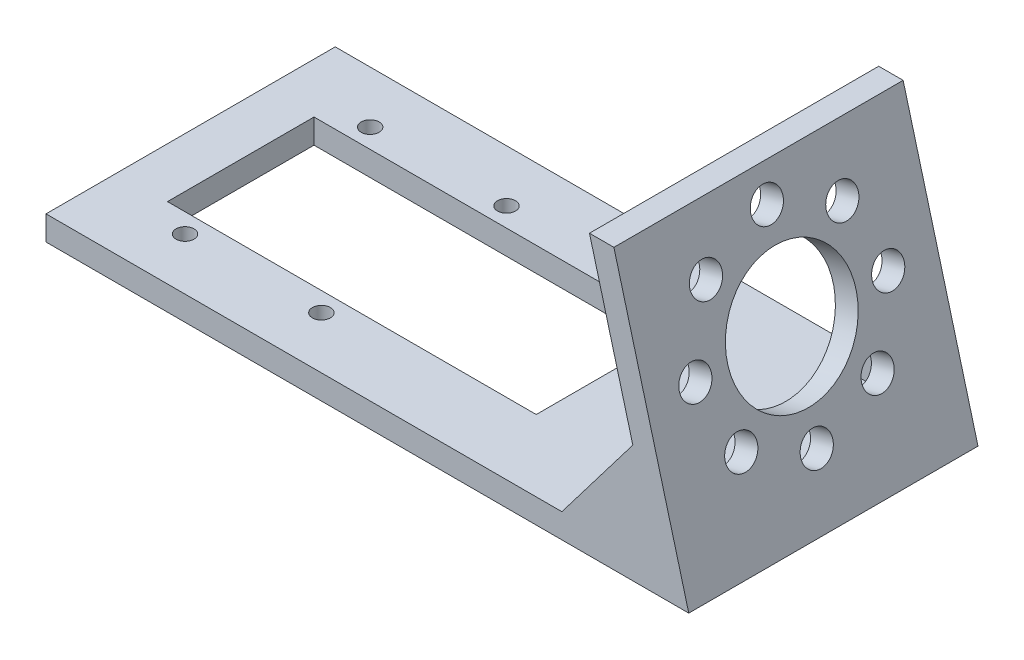
ISO-10303-21;
HEADER;
FILE_DESCRIPTION(('STEP AP214'),'2;1');
FILE_NAME('part.step','',(''),(''),'','','');
FILE_SCHEMA(('AUTOMOTIVE_DESIGN { 1 0 10303 214 1 1 1 1 }'));
ENDSEC;
DATA;
#1=APPLICATION_CONTEXT('core data for automotive mechanical design processes');
#2=APPLICATION_PROTOCOL_DEFINITION('international standard','automotive_design',2000,#1);
#3=PRODUCT_CONTEXT('',#1,'mechanical');
#4=PRODUCT('Part','Part','',(#3));
#5=PRODUCT_RELATED_PRODUCT_CATEGORY('part','',(#4));
#6=PRODUCT_DEFINITION_FORMATION('','',#4);
#7=PRODUCT_DEFINITION_CONTEXT('part definition',#1,'design');
#8=PRODUCT_DEFINITION('design','',#6,#7);
#9=PRODUCT_DEFINITION_SHAPE('','',#8);
#10=(LENGTH_UNIT() NAMED_UNIT(*) SI_UNIT(.MILLI.,.METRE.));
#11=(NAMED_UNIT(*) PLANE_ANGLE_UNIT() SI_UNIT($,.RADIAN.));
#12=(NAMED_UNIT(*) SI_UNIT($,.STERADIAN.) SOLID_ANGLE_UNIT());
#13=UNCERTAINTY_MEASURE_WITH_UNIT(LENGTH_MEASURE(1.E-05),#10,'distance_accuracy_value','');
#14=(GEOMETRIC_REPRESENTATION_CONTEXT(3) GLOBAL_UNCERTAINTY_ASSIGNED_CONTEXT((#13)) GLOBAL_UNIT_ASSIGNED_CONTEXT((#10,
#11,#12)) REPRESENTATION_CONTEXT('',''));
#15=CARTESIAN_POINT('',(0.,0.,0.));
#16=DIRECTION('',(0.,0.,1.));
#17=DIRECTION('',(1.,0.,0.));
#18=AXIS2_PLACEMENT_3D('',#15,#16,#17);
#19=CARTESIAN_POINT('',(57.6024915723907,55.2026609724202,57.15));
#20=DIRECTION('',(0.965925826289067,0.258819045102525,0.));
#21=DIRECTION('',(-0.258819045102525,0.965925826289067,0.));
#22=AXIS2_PLACEMENT_3D('',#19,#20,#21);
#23=PLANE('',#22);
#24=CARTESIAN_POINT('',(64.499776018663,29.4616449846778,47.625));
#25=DIRECTION('',(0.965925826289067,0.258819045102525,0.));
#26=DIRECTION('',(0.,0.,1.));
#27=AXIS2_PLACEMENT_3D('',#24,#25,#26);
#28=CIRCLE('',#27,3.175);
#29=CARTESIAN_POINT('',(64.499776018663,29.4616449846778,50.8));
#30=VERTEX_POINT('',#29);
#31=EDGE_CURVE('E208',#30,#30,#28,.F.);
#32=ORIENTED_EDGE('',*,*,#31,.F.);
#33=EDGE_LOOP('',(#32));
#34=FACE_BOUND('',#33,.T.);
#35=CARTESIAN_POINT('',(67.9861679897098,16.450253013631,42.0453841816037));
#36=DIRECTION('',(0.965925826289067,0.258819045102524,0.));
#37=DIRECTION('',(0.183012701892222,-0.683012701892222,0.707106781186544));
#38=AXIS2_PLACEMENT_3D('',#35,#36,#37);
#39=CIRCLE('',#38,3.175);
#40=CARTESIAN_POINT('',(68.5672333182176,14.2816876851232,44.2904482118709));
#41=VERTEX_POINT('',#40);
#42=EDGE_CURVE('E209',#41,#41,#39,.F.);
#43=ORIENTED_EDGE('',*,*,#42,.F.);
#44=EDGE_LOOP('',(#43));
#45=FACE_BOUND('',#44,.T.);
#46=CARTESIAN_POINT('',(69.4302788278661,11.0607579938711,28.575));
#47=DIRECTION('',(0.965925826289067,0.258819045102524,0.));
#48=DIRECTION('',(0.258819045102524,-0.965925826289068,0.));
#49=AXIS2_PLACEMENT_3D('',#46,#47,#48);
#50=CIRCLE('',#49,3.175);
#51=CARTESIAN_POINT('',(70.2520292960666,7.99394349540336,28.575));
#52=VERTEX_POINT('',#51);
#53=EDGE_CURVE('E216',#52,#52,#50,.F.);
#54=ORIENTED_EDGE('',*,*,#53,.F.);
#55=EDGE_LOOP('',(#54));
#56=FACE_BOUND('',#55,.T.);
#57=CARTESIAN_POINT('',(67.9861679897098,16.4502530136312,15.1046158183961));
#58=DIRECTION('',(0.965925826289067,0.258819045102524,0.));
#59=DIRECTION('',(0.18301270189222,-0.683012701892213,-0.707106781186554));
#60=AXIS2_PLACEMENT_3D('',#57,#58,#59);
#61=CIRCLE('',#60,3.175);
#62=CARTESIAN_POINT('',(68.5672333182176,14.2816876851235,12.8595517881288));
#63=VERTEX_POINT('',#62);
#64=EDGE_CURVE('E222',#63,#63,#61,.F.);
#65=ORIENTED_EDGE('',*,*,#64,.F.);
#66=EDGE_LOOP('',(#65));
#67=FACE_BOUND('',#66,.T.);
#68=CARTESIAN_POINT('',(64.4997760186629,29.4616449846781,9.52499999999998));
#69=DIRECTION('',(0.965925826289067,0.258819045102525,0.));
#70=DIRECTION('',(0.,0.,-1.));
#71=AXIS2_PLACEMENT_3D('',#68,#69,#70);
#72=CIRCLE('',#71,3.175);
#73=CARTESIAN_POINT('',(64.4997760186629,29.4616449846781,6.34999999999998));
#74=VERTEX_POINT('',#73);
#75=EDGE_CURVE('E196',#74,#74,#72,.F.);
#76=ORIENTED_EDGE('',*,*,#75,.F.);
#77=EDGE_LOOP('',(#76));
#78=FACE_BOUND('',#77,.T.);
#79=CARTESIAN_POINT('',(61.0133840476161,42.4730369557248,15.1046158183964));
#80=DIRECTION('',(0.965925826289067,0.258819045102525,0.));
#81=DIRECTION('',(-0.183012701892225,0.683012701892227,-0.707106781186539));
#82=AXIS2_PLACEMENT_3D('',#79,#80,#81);
#83=CIRCLE('',#82,3.175);
#84=CARTESIAN_POINT('',(60.4323187191083,44.6416022842326,12.8595517881292));
#85=VERTEX_POINT('',#84);
#86=EDGE_CURVE('E197',#85,#85,#83,.F.);
#87=ORIENTED_EDGE('',*,*,#86,.F.);
#88=EDGE_LOOP('',(#87));
#89=FACE_BOUND('',#88,.T.);
#90=CARTESIAN_POINT('',(61.0133840476161,42.4730369557246,42.0453841816038));
#91=DIRECTION('',(0.965925826289067,0.258819045102525,0.));
#92=DIRECTION('',(-0.183012701892222,0.683012701892217,0.707106781186549));
#93=AXIS2_PLACEMENT_3D('',#90,#91,#92);
#94=CIRCLE('',#93,3.175);
#95=CARTESIAN_POINT('',(60.4323187191083,44.6416022842324,44.2904482118711));
#96=VERTEX_POINT('',#95);
#97=EDGE_CURVE('E231',#96,#96,#94,.F.);
#98=ORIENTED_EDGE('',*,*,#97,.F.);
#99=EDGE_LOOP('',(#98));
#100=FACE_BOUND('',#99,.T.);
#101=CARTESIAN_POINT('',(59.5692732094599,47.8625319754846,28.575));
#102=DIRECTION('',(0.965925826289067,0.258819045102525,0.));
#103=DIRECTION('',(-0.258819045102525,0.965925826289067,0.));
#104=AXIS2_PLACEMENT_3D('',#101,#102,#103);
#105=CIRCLE('',#104,3.175);
#106=CARTESIAN_POINT('',(58.7475227412594,50.9293464739524,28.575));
#107=VERTEX_POINT('',#106);
#108=EDGE_CURVE('E237',#107,#107,#105,.F.);
#109=ORIENTED_EDGE('',*,*,#108,.F.);
#110=EDGE_LOOP('',(#109));
#111=FACE_BOUND('',#110,.T.);
#112=CARTESIAN_POINT('',(64.499776018663,29.4616449846779,28.575));
#113=DIRECTION('',(0.965925826289067,0.258819045102525,0.));
#114=DIRECTION('',(-0.258819045102525,0.965925826289067,0.));
#115=AXIS2_PLACEMENT_3D('',#112,#113,#114);
#116=CIRCLE('',#115,12.7);
#117=CARTESIAN_POINT('',(61.2127741458609,41.7289029785491,28.575));
#118=VERTEX_POINT('',#117);
#119=EDGE_CURVE('E241',#118,#118,#116,.F.);
#120=ORIENTED_EDGE('',*,*,#119,.F.);
#121=EDGE_LOOP('',(#120));
#122=FACE_BOUND('',#121,.T.);
#123=DIRECTION('',(0.258819045102525,-0.965925826289067,0.));
#124=VECTOR('',#123,1.);
#125=CARTESIAN_POINT('',(57.6024915723907,55.2026609724202,0.));
#126=LINE('',#125,#124);
#127=CARTESIAN_POINT('',(57.6024915723907,55.2026609724202,0.));
#128=VERTEX_POINT('',#127);
#129=CARTESIAN_POINT('',(66.1703743881243,23.2268869908067,0.));
#130=VERTEX_POINT('',#129);
#131=EDGE_CURVE('E300',#128,#130,#126,.T.);
#132=ORIENTED_EDGE('',*,*,#131,.T.);
#133=DIRECTION('',(0.,0.,-1.));
#134=VECTOR('',#133,1.);
#135=CARTESIAN_POINT('',(66.1703743881243,23.2268869908067,4.82600000000001));
#136=LINE('',#135,#134);
#137=CARTESIAN_POINT('',(66.1703743881243,23.2268869908068,4.82600000000001));
#138=VERTEX_POINT('',#137);
#139=EDGE_CURVE('E254',#138,#130,#136,.T.);
#140=ORIENTED_EDGE('',*,*,#139,.F.);
#141=DIRECTION('',(0.258819045102525,-0.965925826289067,0.));
#142=VECTOR('',#141,1.);
#143=CARTESIAN_POINT('',(67.5445215407852,18.0985000000003,4.82600000000001));
#144=LINE('',#143,#142);
#145=CARTESIAN_POINT('',(71.1008771973274,4.826,4.82600000000001));
#146=VERTEX_POINT('',#145);
#147=EDGE_CURVE('E250',#138,#146,#144,.T.);
#148=ORIENTED_EDGE('',*,*,#147,.T.);
#149=DIRECTION('',(0.,0.,-1.));
#150=VECTOR('',#149,1.);
#151=CARTESIAN_POINT('',(71.1008771973274,4.826,57.15));
#152=LINE('',#151,#150);
#153=CARTESIAN_POINT('',(71.1008771973274,4.826,52.324));
#154=VERTEX_POINT('',#153);
#155=EDGE_CURVE('E305',#154,#146,#152,.T.);
#156=ORIENTED_EDGE('',*,*,#155,.F.);
#157=DIRECTION('',(0.258819045102525,-0.965925826289067,0.));
#158=VECTOR('',#157,1.);
#159=CARTESIAN_POINT('',(67.5445215407852,18.0985000000003,52.324));
#160=LINE('',#159,#158);
#161=CARTESIAN_POINT('',(66.1703743881243,23.2268869908068,52.324));
#162=VERTEX_POINT('',#161);
#163=EDGE_CURVE('E266',#162,#154,#160,.T.);
#164=ORIENTED_EDGE('',*,*,#163,.F.);
#165=DIRECTION('',(0.,0.,1.));
#166=VECTOR('',#165,1.);
#167=CARTESIAN_POINT('',(66.1703743881243,23.2268869908068,52.324));
#168=LINE('',#167,#166);
#169=CARTESIAN_POINT('',(66.1703743881243,23.2268869908068,57.15));
#170=VERTEX_POINT('',#169);
#171=EDGE_CURVE('E270',#162,#170,#168,.T.);
#172=ORIENTED_EDGE('',*,*,#171,.T.);
#173=DIRECTION('',(0.258819045102525,-0.965925826289067,0.));
#174=VECTOR('',#173,1.);
#175=CARTESIAN_POINT('',(57.6024915723907,55.2026609724202,57.15));
#176=LINE('',#175,#174);
#177=CARTESIAN_POINT('',(57.6024915723907,55.2026609724202,57.15));
#178=VERTEX_POINT('',#177);
#179=EDGE_CURVE('E286',#178,#170,#176,.T.);
#180=ORIENTED_EDGE('',*,*,#179,.F.);
#181=DIRECTION('',(0.,0.,-1.));
#182=VECTOR('',#181,1.);
#183=CARTESIAN_POINT('',(57.6024915723907,55.2026609724202,57.15));
#184=LINE('',#183,#182);
#185=EDGE_CURVE('E308',#178,#128,#184,.T.);
#186=ORIENTED_EDGE('',*,*,#185,.T.);
#187=EDGE_LOOP('',(#132,#140,#148,#156,#164,#172,#180,#186));
#188=FACE_BOUND('',#187,.T.);
#189=ADVANCED_FACE('F39',(#34,#45,#56,#67,#78,#89,#100,#111,#122,#188),#23,.F.);
#190=CARTESIAN_POINT('',(71.1008771973274,4.826,57.15));
#191=DIRECTION('',(0.,-1.,0.));
#192=DIRECTION('',(1.,0.,0.));
#193=AXIS2_PLACEMENT_3D('',#190,#191,#192);
#194=PLANE('',#193);
#195=CARTESIAN_POINT('',(-32.595884,4.826,10.287));
#196=DIRECTION('',(0.,-1.,0.));
#197=DIRECTION('',(-1.,0.,0.));
#198=AXIS2_PLACEMENT_3D('',#195,#196,#197);
#199=CIRCLE('',#198,1.778);
#200=CARTESIAN_POINT('',(-34.373884,4.826,10.287));
#201=VERTEX_POINT('',#200);
#202=EDGE_CURVE('E397',#201,#201,#199,.T.);
#203=ORIENTED_EDGE('',*,*,#202,.T.);
#204=EDGE_LOOP('',(#203));
#205=FACE_BOUND('',#204,.T.);
#206=CARTESIAN_POINT('',(-5.65512000000001,4.826,10.287));
#207=DIRECTION('',(0.,-1.,0.));
#208=DIRECTION('',(-1.,0.,0.));
#209=AXIS2_PLACEMENT_3D('',#206,#207,#208);
#210=CIRCLE('',#209,1.778);
#211=CARTESIAN_POINT('',(-7.43312000000001,4.826,10.287));
#212=VERTEX_POINT('',#211);
#213=EDGE_CURVE('E164',#212,#212,#210,.T.);
#214=ORIENTED_EDGE('',*,*,#213,.T.);
#215=EDGE_LOOP('',(#214));
#216=FACE_BOUND('',#215,.T.);
#217=DIRECTION('',(0.,0.,1.));
#218=VECTOR('',#217,1.);
#219=CARTESIAN_POINT('',(-39.874,4.826,43.053));
#220=LINE('',#219,#218);
#221=CARTESIAN_POINT('',(-39.874,4.826,14.097));
#222=VERTEX_POINT('',#221);
#223=CARTESIAN_POINT('',(-39.874,4.826,43.053));
#224=VERTEX_POINT('',#223);
#225=EDGE_CURVE('E170',#222,#224,#220,.T.);
#226=ORIENTED_EDGE('',*,*,#225,.F.);
#227=DIRECTION('',(-1.,0.,0.));
#228=VECTOR('',#227,1.);
#229=CARTESIAN_POINT('',(-39.874,4.826,14.097));
#230=LINE('',#229,#228);
#231=CARTESIAN_POINT('',(32.98844,4.826,14.097));
#232=VERTEX_POINT('',#231);
#233=EDGE_CURVE('E54',#232,#222,#230,.T.);
#234=ORIENTED_EDGE('',*,*,#233,.F.);
#235=DIRECTION('',(0.,0.,-1.));
#236=VECTOR('',#235,1.);
#237=CARTESIAN_POINT('',(32.98844,4.826,14.097));
#238=LINE('',#237,#236);
#239=CARTESIAN_POINT('',(32.98844,4.826,43.053));
#240=VERTEX_POINT('',#239);
#241=EDGE_CURVE('E158',#240,#232,#238,.T.);
#242=ORIENTED_EDGE('',*,*,#241,.F.);
#243=DIRECTION('',(1.,0.,0.));
#244=VECTOR('',#243,1.);
#245=CARTESIAN_POINT('',(-39.874,4.826,43.053));
#246=LINE('',#245,#244);
#247=EDGE_CURVE('E161',#224,#240,#246,.T.);
#248=ORIENTED_EDGE('',*,*,#247,.F.);
#249=EDGE_LOOP('',(#226,#234,#242,#248));
#250=FACE_BOUND('',#249,.T.);
#251=CARTESIAN_POINT('',(-32.595884,4.826,46.863));
#252=DIRECTION('',(0.,1.,0.));
#253=DIRECTION('',(-1.,0.,0.));
#254=AXIS2_PLACEMENT_3D('',#251,#252,#253);
#255=CIRCLE('',#254,1.778);
#256=CARTESIAN_POINT('',(-34.373884,4.826,46.863));
#257=VERTEX_POINT('',#256);
#258=EDGE_CURVE('E183',#257,#257,#255,.T.);
#259=ORIENTED_EDGE('',*,*,#258,.F.);
#260=EDGE_LOOP('',(#259));
#261=FACE_BOUND('',#260,.T.);
#262=CARTESIAN_POINT('',(-5.65512000000001,4.826,46.863));
#263=DIRECTION('',(0.,1.,0.));
#264=DIRECTION('',(-1.,0.,0.));
#265=AXIS2_PLACEMENT_3D('',#262,#263,#264);
#266=CIRCLE('',#265,1.778);
#267=CARTESIAN_POINT('',(-7.43312000000001,4.826,46.863));
#268=VERTEX_POINT('',#267);
#269=EDGE_CURVE('E189',#268,#268,#266,.T.);
#270=ORIENTED_EDGE('',*,*,#269,.F.);
#271=EDGE_LOOP('',(#270));
#272=FACE_BOUND('',#271,.T.);
#273=DIRECTION('',(-1.,0.,0.));
#274=VECTOR('',#273,1.);
#275=CARTESIAN_POINT('',(0.,4.826,4.82600000000001));
#276=LINE('',#275,#274);
#277=CARTESIAN_POINT('',(52.1482550347824,4.826,4.82600000000001));
#278=VERTEX_POINT('',#277);
#279=EDGE_CURVE('E252',#146,#278,#276,.T.);
#280=ORIENTED_EDGE('',*,*,#279,.T.);
#281=DIRECTION('',(0.,0.,-1.));
#282=VECTOR('',#281,1.);
#283=CARTESIAN_POINT('',(52.1482550347824,4.826,4.82600000000001));
#284=LINE('',#283,#282);
#285=CARTESIAN_POINT('',(52.1482550347824,4.826,0.));
#286=VERTEX_POINT('',#285);
#287=EDGE_CURVE('E257',#278,#286,#284,.T.);
#288=ORIENTED_EDGE('',*,*,#287,.T.);
#289=DIRECTION('',(-1.,0.,0.));
#290=VECTOR('',#289,1.);
#291=CARTESIAN_POINT('',(71.1008771973274,4.826,0.));
#292=LINE('',#291,#290);
#293=CARTESIAN_POINT('',(-49.78,4.826,0.));
#294=VERTEX_POINT('',#293);
#295=EDGE_CURVE('E280',#286,#294,#292,.T.);
#296=ORIENTED_EDGE('',*,*,#295,.T.);
#297=DIRECTION('',(0.,0.,-1.));
#298=VECTOR('',#297,1.);
#299=CARTESIAN_POINT('',(-49.78,4.826,57.15));
#300=LINE('',#299,#298);
#301=CARTESIAN_POINT('',(-49.78,4.826,57.15));
#302=VERTEX_POINT('',#301);
#303=EDGE_CURVE('E291',#302,#294,#300,.T.);
#304=ORIENTED_EDGE('',*,*,#303,.F.);
#305=DIRECTION('',(-1.,0.,0.));
#306=VECTOR('',#305,1.);
#307=CARTESIAN_POINT('',(71.1008771973274,4.826,57.15));
#308=LINE('',#307,#306);
#309=CARTESIAN_POINT('',(52.1482550347824,4.826,57.15));
#310=VERTEX_POINT('',#309);
#311=EDGE_CURVE('E289',#310,#302,#308,.T.);
#312=ORIENTED_EDGE('',*,*,#311,.F.);
#313=DIRECTION('',(0.,0.,1.));
#314=VECTOR('',#313,1.);
#315=CARTESIAN_POINT('',(52.1482550347824,4.826,52.324));
#316=LINE('',#315,#314);
#317=CARTESIAN_POINT('',(52.1482550347824,4.826,52.324));
#318=VERTEX_POINT('',#317);
#319=EDGE_CURVE('E268',#318,#310,#316,.T.);
#320=ORIENTED_EDGE('',*,*,#319,.F.);
#321=DIRECTION('',(-1.,0.,0.));
#322=VECTOR('',#321,1.);
#323=CARTESIAN_POINT('',(0.,4.826,52.324));
#324=LINE('',#323,#322);
#325=EDGE_CURVE('E264',#154,#318,#324,.T.);
#326=ORIENTED_EDGE('',*,*,#325,.F.);
#327=ORIENTED_EDGE('',*,*,#155,.T.);
#328=EDGE_LOOP('',(#280,#288,#296,#304,#312,#320,#326,#327));
#329=FACE_BOUND('',#328,.T.);
#330=ADVANCED_FACE('F352',(#205,#216,#250,#261,#272,#329),#194,.F.);
#331=CARTESIAN_POINT('',(-49.78,4.826,57.15));
#332=DIRECTION('',(1.,0.,0.));
#333=DIRECTION('',(0.,0.,-1.));
#334=AXIS2_PLACEMENT_3D('',#331,#332,#333);
#335=PLANE('',#334);
#336=DIRECTION('',(0.,-1.,0.));
#337=VECTOR('',#336,1.);
#338=CARTESIAN_POINT('',(-49.78,4.826,0.));
#339=LINE('',#338,#337);
#340=CARTESIAN_POINT('',(-49.78,0.,0.));
#341=VERTEX_POINT('',#340);
#342=EDGE_CURVE('E273',#294,#341,#339,.T.);
#343=ORIENTED_EDGE('',*,*,#342,.T.);
#344=DIRECTION('',(0.,0.,-1.));
#345=VECTOR('',#344,1.);
#346=CARTESIAN_POINT('',(-49.78,0.,57.15));
#347=LINE('',#346,#345);
#348=CARTESIAN_POINT('',(-49.78,0.,57.15));
#349=VERTEX_POINT('',#348);
#350=EDGE_CURVE('E11',#349,#341,#347,.T.);
#351=ORIENTED_EDGE('',*,*,#350,.F.);
#352=DIRECTION('',(0.,-1.,0.));
#353=VECTOR('',#352,1.);
#354=CARTESIAN_POINT('',(-49.78,4.826,57.15));
#355=LINE('',#354,#353);
#356=EDGE_CURVE('E276',#302,#349,#355,.T.);
#357=ORIENTED_EDGE('',*,*,#356,.F.);
#358=ORIENTED_EDGE('',*,*,#303,.T.);
#359=EDGE_LOOP('',(#343,#351,#357,#358));
#360=FACE_BOUND('',#359,.T.);
#361=ADVANCED_FACE('F41',(#360),#335,.F.);
#362=CARTESIAN_POINT('',(-49.78,0.,57.15));
#363=DIRECTION('',(0.,1.,0.));
#364=DIRECTION('',(0.,0.,1.));
#365=AXIS2_PLACEMENT_3D('',#362,#363,#364);
#366=PLANE('',#365);
#367=CARTESIAN_POINT('',(-32.595884,0.,10.287));
#368=DIRECTION('',(0.,-1.,0.));
#369=DIRECTION('',(-1.,0.,0.));
#370=AXIS2_PLACEMENT_3D('',#367,#368,#369);
#371=CIRCLE('',#370,1.778);
#372=CARTESIAN_POINT('',(-34.373884,0.,10.287));
#373=VERTEX_POINT('',#372);
#374=EDGE_CURVE('E192',#373,#373,#371,.T.);
#375=ORIENTED_EDGE('',*,*,#374,.F.);
#376=EDGE_LOOP('',(#375));
#377=FACE_BOUND('',#376,.T.);
#378=CARTESIAN_POINT('',(-5.65512000000001,0.,10.287));
#379=DIRECTION('',(0.,-1.,0.));
#380=DIRECTION('',(-1.,0.,0.));
#381=AXIS2_PLACEMENT_3D('',#378,#379,#380);
#382=CIRCLE('',#381,1.778);
#383=CARTESIAN_POINT('',(-7.43312000000001,0.,10.287));
#384=VERTEX_POINT('',#383);
#385=EDGE_CURVE('E395',#384,#384,#382,.T.);
#386=ORIENTED_EDGE('',*,*,#385,.F.);
#387=EDGE_LOOP('',(#386));
#388=FACE_BOUND('',#387,.T.);
#389=DIRECTION('',(0.,0.,-1.));
#390=VECTOR('',#389,1.);
#391=CARTESIAN_POINT('',(32.98844,0.,14.097));
#392=LINE('',#391,#390);
#393=CARTESIAN_POINT('',(32.98844,0.,43.053));
#394=VERTEX_POINT('',#393);
#395=CARTESIAN_POINT('',(32.98844,0.,14.097));
#396=VERTEX_POINT('',#395);
#397=EDGE_CURVE('E148',#394,#396,#392,.T.);
#398=ORIENTED_EDGE('',*,*,#397,.T.);
#399=DIRECTION('',(-1.,0.,0.));
#400=VECTOR('',#399,1.);
#401=CARTESIAN_POINT('',(-39.874,0.,14.097));
#402=LINE('',#401,#400);
#403=CARTESIAN_POINT('',(-39.874,0.,14.097));
#404=VERTEX_POINT('',#403);
#405=EDGE_CURVE('E142',#396,#404,#402,.T.);
#406=ORIENTED_EDGE('',*,*,#405,.T.);
#407=DIRECTION('',(0.,0.,1.));
#408=VECTOR('',#407,1.);
#409=CARTESIAN_POINT('',(-39.874,0.,43.053));
#410=LINE('',#409,#408);
#411=CARTESIAN_POINT('',(-39.874,0.,43.053));
#412=VERTEX_POINT('',#411);
#413=EDGE_CURVE('E151',#404,#412,#410,.T.);
#414=ORIENTED_EDGE('',*,*,#413,.T.);
#415=DIRECTION('',(1.,0.,0.));
#416=VECTOR('',#415,1.);
#417=CARTESIAN_POINT('',(-39.874,0.,43.053));
#418=LINE('',#417,#416);
#419=EDGE_CURVE('E62',#412,#394,#418,.T.);
#420=ORIENTED_EDGE('',*,*,#419,.T.);
#421=EDGE_LOOP('',(#398,#406,#414,#420));
#422=FACE_BOUND('',#421,.T.);
#423=CARTESIAN_POINT('',(-32.595884,0.,46.863));
#424=DIRECTION('',(0.,1.,0.));
#425=DIRECTION('',(-1.,0.,0.));
#426=AXIS2_PLACEMENT_3D('',#423,#424,#425);
#427=CIRCLE('',#426,1.778);
#428=CARTESIAN_POINT('',(-34.373884,0.,46.863));
#429=VERTEX_POINT('',#428);
#430=EDGE_CURVE('E171',#429,#429,#427,.T.);
#431=ORIENTED_EDGE('',*,*,#430,.T.);
#432=EDGE_LOOP('',(#431));
#433=FACE_BOUND('',#432,.T.);
#434=CARTESIAN_POINT('',(-5.65512000000001,0.,46.863));
#435=DIRECTION('',(0.,1.,0.));
#436=DIRECTION('',(-1.,0.,0.));
#437=AXIS2_PLACEMENT_3D('',#434,#435,#436);
#438=CIRCLE('',#437,1.778);
#439=CARTESIAN_POINT('',(-7.43312000000001,0.,46.863));
#440=VERTEX_POINT('',#439);
#441=EDGE_CURVE('E186',#440,#440,#438,.T.);
#442=ORIENTED_EDGE('',*,*,#441,.T.);
#443=EDGE_LOOP('',(#442));
#444=FACE_BOUND('',#443,.T.);
#445=DIRECTION('',(1.,0.,0.));
#446=VECTOR('',#445,1.);
#447=CARTESIAN_POINT('',(-49.78,0.,0.));
#448=LINE('',#447,#446);
#449=CARTESIAN_POINT('',(77.22,0.,0.));
#450=VERTEX_POINT('',#449);
#451=EDGE_CURVE('E294',#341,#450,#448,.T.);
#452=ORIENTED_EDGE('',*,*,#451,.T.);
#453=DIRECTION('',(0.,0.,-1.));
#454=VECTOR('',#453,1.);
#455=CARTESIAN_POINT('',(77.22,0.,57.15));
#456=LINE('',#455,#454);
#457=CARTESIAN_POINT('',(77.22,0.,57.15));
#458=VERTEX_POINT('',#457);
#459=EDGE_CURVE('E47',#458,#450,#456,.T.);
#460=ORIENTED_EDGE('',*,*,#459,.F.);
#461=DIRECTION('',(1.,0.,0.));
#462=VECTOR('',#461,1.);
#463=CARTESIAN_POINT('',(-49.78,0.,57.15));
#464=LINE('',#463,#462);
#465=EDGE_CURVE('E279',#349,#458,#464,.T.);
#466=ORIENTED_EDGE('',*,*,#465,.F.);
#467=ORIENTED_EDGE('',*,*,#350,.T.);
#468=EDGE_LOOP('',(#452,#460,#466,#467));
#469=FACE_BOUND('',#468,.T.);
#470=ADVANCED_FACE('F155',(#377,#388,#422,#433,#444,#469),#366,.F.);
#471=CARTESIAN_POINT('',(77.22,0.,57.15));
#472=DIRECTION('',(-0.965925826289067,-0.258819045102525,0.));
#473=DIRECTION('',(0.258819045102525,-0.965925826289067,0.));
#474=AXIS2_PLACEMENT_3D('',#471,#472,#473);
#475=PLANE('',#474);
#476=CARTESIAN_POINT('',(69.0024953179949,30.6681449846779,47.625));
#477=DIRECTION('',(0.965925826289067,0.258819045102525,0.));
#478=DIRECTION('',(0.,0.,1.));
#479=AXIS2_PLACEMENT_3D('',#476,#477,#478);
#480=CIRCLE('',#479,3.175);
#481=CARTESIAN_POINT('',(69.0024953179949,30.6681449846778,50.8));
#482=VERTEX_POINT('',#481);
#483=EDGE_CURVE('E205',#482,#482,#480,.T.);
#484=ORIENTED_EDGE('',*,*,#483,.F.);
#485=EDGE_LOOP('',(#484));
#486=FACE_BOUND('',#485,.T.);
#487=CARTESIAN_POINT('',(72.4888872890417,17.6567530136311,42.0453841816037));
#488=DIRECTION('',(0.965925826289068,0.258819045102524,0.));
#489=DIRECTION('',(0.183012701892223,-0.683012701892222,0.707106781186544));
#490=AXIS2_PLACEMENT_3D('',#487,#488,#489);
#491=CIRCLE('',#490,3.175);
#492=CARTESIAN_POINT('',(73.0699526175495,15.4881876851233,44.2904482118709));
#493=VERTEX_POINT('',#492);
#494=EDGE_CURVE('E213',#493,#493,#491,.T.);
#495=ORIENTED_EDGE('',*,*,#494,.F.);
#496=EDGE_LOOP('',(#495));
#497=FACE_BOUND('',#496,.T.);
#498=CARTESIAN_POINT('',(73.9329981271979,12.2672579938712,28.575));
#499=DIRECTION('',(0.965925826289068,0.258819045102524,0.));
#500=DIRECTION('',(0.258819045102525,-0.965925826289068,0.));
#501=AXIS2_PLACEMENT_3D('',#498,#499,#500);
#502=CIRCLE('',#501,3.175);
#503=CARTESIAN_POINT('',(74.7547485953985,9.20044349540339,28.575));
#504=VERTEX_POINT('',#503);
#505=EDGE_CURVE('E219',#504,#504,#502,.T.);
#506=ORIENTED_EDGE('',*,*,#505,.F.);
#507=EDGE_LOOP('',(#506));
#508=FACE_BOUND('',#507,.T.);
#509=CARTESIAN_POINT('',(72.4888872890417,17.6567530136313,15.1046158183961));
#510=DIRECTION('',(0.965925826289067,0.258819045102525,0.));
#511=DIRECTION('',(0.18301270189222,-0.683012701892213,-0.707106781186554));
#512=AXIS2_PLACEMENT_3D('',#509,#510,#511);
#513=CIRCLE('',#512,3.175);
#514=CARTESIAN_POINT('',(73.0699526175494,15.4881876851235,12.8595517881288));
#515=VERTEX_POINT('',#514);
#516=EDGE_CURVE('E200',#515,#515,#513,.T.);
#517=ORIENTED_EDGE('',*,*,#516,.F.);
#518=EDGE_LOOP('',(#517));
#519=FACE_BOUND('',#518,.T.);
#520=CARTESIAN_POINT('',(69.0024953179948,30.6681449846781,9.52499999999998));
#521=DIRECTION('',(0.965925826289068,0.258819045102525,0.));
#522=DIRECTION('',(0.,0.,-1.));
#523=AXIS2_PLACEMENT_3D('',#520,#521,#522);
#524=CIRCLE('',#523,3.175);
#525=CARTESIAN_POINT('',(69.0024953179948,30.6681449846781,6.34999999999998));
#526=VERTEX_POINT('',#525);
#527=EDGE_CURVE('E193',#526,#526,#524,.T.);
#528=ORIENTED_EDGE('',*,*,#527,.F.);
#529=EDGE_LOOP('',(#528));
#530=FACE_BOUND('',#529,.T.);
#531=CARTESIAN_POINT('',(65.516103346948,43.6795369557248,15.1046158183964));
#532=DIRECTION('',(0.965925826289067,0.258819045102525,0.));
#533=DIRECTION('',(-0.183012701892225,0.683012701892227,-0.707106781186539));
#534=AXIS2_PLACEMENT_3D('',#531,#532,#533);
#535=CIRCLE('',#534,3.175);
#536=CARTESIAN_POINT('',(64.9350380184402,45.8481022842327,12.8595517881292));
#537=VERTEX_POINT('',#536);
#538=EDGE_CURVE('E177',#537,#537,#535,.T.);
#539=ORIENTED_EDGE('',*,*,#538,.F.);
#540=EDGE_LOOP('',(#539));
#541=FACE_BOUND('',#540,.T.);
#542=CARTESIAN_POINT('',(65.516103346948,43.6795369557247,42.0453841816038));
#543=DIRECTION('',(0.965925826289067,0.258819045102525,0.));
#544=DIRECTION('',(-0.183012701892222,0.683012701892217,0.707106781186549));
#545=AXIS2_PLACEMENT_3D('',#542,#543,#544);
#546=CIRCLE('',#545,3.175);
#547=CARTESIAN_POINT('',(64.9350380184402,45.8481022842325,44.2904482118711));
#548=VERTEX_POINT('',#547);
#549=EDGE_CURVE('E212',#548,#548,#546,.T.);
#550=ORIENTED_EDGE('',*,*,#549,.F.);
#551=EDGE_LOOP('',(#550));
#552=FACE_BOUND('',#551,.T.);
#553=CARTESIAN_POINT('',(64.0719925087917,49.0690319754847,28.575));
#554=DIRECTION('',(0.965925826289067,0.258819045102525,0.));
#555=DIRECTION('',(-0.258819045102525,0.965925826289067,0.));
#556=AXIS2_PLACEMENT_3D('',#553,#554,#555);
#557=CIRCLE('',#556,3.175);
#558=CARTESIAN_POINT('',(63.2502420405912,52.1358464739524,28.575));
#559=VERTEX_POINT('',#558);
#560=EDGE_CURVE('E234',#559,#559,#557,.T.);
#561=ORIENTED_EDGE('',*,*,#560,.F.);
#562=EDGE_LOOP('',(#561));
#563=FACE_BOUND('',#562,.T.);
#564=CARTESIAN_POINT('',(69.0024953179949,30.6681449846779,28.575));
#565=DIRECTION('',(0.965925826289067,0.258819045102525,0.));
#566=DIRECTION('',(-0.258819045102525,0.965925826289067,0.));
#567=AXIS2_PLACEMENT_3D('',#564,#565,#566);
#568=CIRCLE('',#567,12.7);
#569=CARTESIAN_POINT('',(65.7154934451928,42.9354029785491,28.575));
#570=VERTEX_POINT('',#569);
#571=EDGE_CURVE('E240',#570,#570,#568,.T.);
#572=ORIENTED_EDGE('',*,*,#571,.F.);
#573=EDGE_LOOP('',(#572));
#574=FACE_BOUND('',#573,.T.);
#575=DIRECTION('',(-0.258819045102525,0.965925826289067,0.));
#576=VECTOR('',#575,1.);
#577=CARTESIAN_POINT('',(77.22,0.,0.));
#578=LINE('',#577,#576);
#579=CARTESIAN_POINT('',(62.4284915723907,55.2026609724202,0.));
#580=VERTEX_POINT('',#579);
#581=EDGE_CURVE('E296',#450,#580,#578,.T.);
#582=ORIENTED_EDGE('',*,*,#581,.T.);
#583=DIRECTION('',(0.,0.,-1.));
#584=VECTOR('',#583,1.);
#585=CARTESIAN_POINT('',(62.4284915723907,55.2026609724202,57.15));
#586=LINE('',#585,#584);
#587=CARTESIAN_POINT('',(62.4284915723907,55.2026609724202,57.15));
#588=VERTEX_POINT('',#587);
#589=EDGE_CURVE('E311',#588,#580,#586,.T.);
#590=ORIENTED_EDGE('',*,*,#589,.F.);
#591=DIRECTION('',(-0.258819045102525,0.965925826289067,0.));
#592=VECTOR('',#591,1.);
#593=CARTESIAN_POINT('',(77.22,0.,57.15));
#594=LINE('',#593,#592);
#595=EDGE_CURVE('E282',#458,#588,#594,.T.);
#596=ORIENTED_EDGE('',*,*,#595,.F.);
#597=ORIENTED_EDGE('',*,*,#459,.T.);
#598=EDGE_LOOP('',(#582,#590,#596,#597));
#599=FACE_BOUND('',#598,.T.);
#600=ADVANCED_FACE('F318',(#486,#497,#508,#519,#530,#541,#552,#563,#574,#599),#475,.F.);
#601=CARTESIAN_POINT('',(62.4284915723907,55.2026609724202,57.15));
#602=DIRECTION('',(0.,-1.,0.));
#603=DIRECTION('',(0.,0.,-1.));
#604=AXIS2_PLACEMENT_3D('',#601,#602,#603);
#605=PLANE('',#604);
#606=DIRECTION('',(-1.,0.,0.));
#607=VECTOR('',#606,1.);
#608=CARTESIAN_POINT('',(62.4284915723907,55.2026609724202,0.));
#609=LINE('',#608,#607);
#610=EDGE_CURVE('E298',#580,#128,#609,.T.);
#611=ORIENTED_EDGE('',*,*,#610,.T.);
#612=ORIENTED_EDGE('',*,*,#185,.F.);
#613=DIRECTION('',(-1.,0.,0.));
#614=VECTOR('',#613,1.);
#615=CARTESIAN_POINT('',(62.4284915723907,55.2026609724202,57.15));
#616=LINE('',#615,#614);
#617=EDGE_CURVE('E284',#588,#178,#616,.T.);
#618=ORIENTED_EDGE('',*,*,#617,.F.);
#619=ORIENTED_EDGE('',*,*,#589,.T.);
#620=EDGE_LOOP('',(#611,#612,#618,#619));
#621=FACE_BOUND('',#620,.T.);
#622=ADVANCED_FACE('F329',(#621),#605,.F.);
#623=CARTESIAN_POINT('',(0.,0.,57.15));
#624=DIRECTION('',(0.,0.,1.));
#625=DIRECTION('',(1.,0.,0.));
#626=AXIS2_PLACEMENT_3D('',#623,#624,#625);
#627=PLANE('',#626);
#628=ORIENTED_EDGE('',*,*,#356,.T.);
#629=ORIENTED_EDGE('',*,*,#465,.T.);
#630=ORIENTED_EDGE('',*,*,#595,.T.);
#631=ORIENTED_EDGE('',*,*,#617,.T.);
#632=ORIENTED_EDGE('',*,*,#179,.T.);
#633=DIRECTION('',(0.606108739732748,0.795381792361115,0.));
#634=VECTOR('',#633,1.);
#635=CARTESIAN_POINT('',(30.6641090884171,-23.3671234281533,57.15));
#636=LINE('',#635,#634);
#637=EDGE_CURVE('E259',#310,#170,#636,.T.);
#638=ORIENTED_EDGE('',*,*,#637,.F.);
#639=ORIENTED_EDGE('',*,*,#311,.T.);
#640=EDGE_LOOP('',(#628,#629,#630,#631,#632,#638,#639));
#641=FACE_BOUND('',#640,.T.);
#642=ADVANCED_FACE('F336',(#641),#627,.T.);
#643=CARTESIAN_POINT('',(0.,0.,0.));
#644=DIRECTION('',(0.,0.,1.));
#645=DIRECTION('',(1.,0.,0.));
#646=AXIS2_PLACEMENT_3D('',#643,#644,#645);
#647=PLANE('',#646);
#648=ORIENTED_EDGE('',*,*,#295,.F.);
#649=DIRECTION('',(0.606108739732748,0.795381792361115,0.));
#650=VECTOR('',#649,1.);
#651=CARTESIAN_POINT('',(30.6641090884171,-23.3671234281533,0.));
#652=LINE('',#651,#650);
#653=EDGE_CURVE('E244',#286,#130,#652,.T.);
#654=ORIENTED_EDGE('',*,*,#653,.T.);
#655=ORIENTED_EDGE('',*,*,#131,.F.);
#656=ORIENTED_EDGE('',*,*,#610,.F.);
#657=ORIENTED_EDGE('',*,*,#581,.F.);
#658=ORIENTED_EDGE('',*,*,#451,.F.);
#659=ORIENTED_EDGE('',*,*,#342,.F.);
#660=EDGE_LOOP('',(#648,#654,#655,#656,#657,#658,#659));
#661=FACE_BOUND('',#660,.T.);
#662=ADVANCED_FACE('F324',(#661),#647,.F.);
#663=CARTESIAN_POINT('',(30.6641090884171,-23.3671234281533,52.324));
#664=DIRECTION('',(0.795381792361115,-0.606108739732748,0.));
#665=DIRECTION('',(0.606108739732748,0.795381792361115,0.));
#666=AXIS2_PLACEMENT_3D('',#663,#664,#665);
#667=PLANE('',#666);
#668=ORIENTED_EDGE('',*,*,#637,.T.);
#669=ORIENTED_EDGE('',*,*,#171,.F.);
#670=DIRECTION('',(0.606108739732748,0.795381792361115,0.));
#671=VECTOR('',#670,1.);
#672=CARTESIAN_POINT('',(30.6641090884171,-23.3671234281533,52.324));
#673=LINE('',#672,#671);
#674=EDGE_CURVE('E262',#318,#162,#673,.T.);
#675=ORIENTED_EDGE('',*,*,#674,.F.);
#676=ORIENTED_EDGE('',*,*,#319,.T.);
#677=EDGE_LOOP('',(#668,#669,#675,#676));
#678=FACE_BOUND('',#677,.T.);
#679=ADVANCED_FACE('F359',(#678),#667,.F.);
#680=CARTESIAN_POINT('',(0.,0.,52.324));
#681=DIRECTION('',(0.,0.,1.));
#682=DIRECTION('',(1.,0.,0.));
#683=AXIS2_PLACEMENT_3D('',#680,#681,#682);
#684=PLANE('',#683);
#685=ORIENTED_EDGE('',*,*,#674,.T.);
#686=ORIENTED_EDGE('',*,*,#163,.T.);
#687=ORIENTED_EDGE('',*,*,#325,.T.);
#688=EDGE_LOOP('',(#685,#686,#687));
#689=FACE_BOUND('',#688,.T.);
#690=ADVANCED_FACE('F356',(#689),#684,.F.);
#691=CARTESIAN_POINT('',(30.6641090884171,-23.3671234281533,4.82600000000002));
#692=DIRECTION('',(-0.795381792361115,0.606108739732748,0.));
#693=DIRECTION('',(-0.606108739732748,-0.795381792361115,0.));
#694=AXIS2_PLACEMENT_3D('',#691,#692,#693);
#695=PLANE('',#694);
#696=ORIENTED_EDGE('',*,*,#653,.F.);
#697=ORIENTED_EDGE('',*,*,#287,.F.);
#698=DIRECTION('',(0.606108739732748,0.795381792361115,0.));
#699=VECTOR('',#698,1.);
#700=CARTESIAN_POINT('',(30.6641090884171,-23.3671234281533,4.82600000000002));
#701=LINE('',#700,#699);
#702=EDGE_CURVE('E247',#278,#138,#701,.T.);
#703=ORIENTED_EDGE('',*,*,#702,.T.);
#704=ORIENTED_EDGE('',*,*,#139,.T.);
#705=EDGE_LOOP('',(#696,#697,#703,#704));
#706=FACE_BOUND('',#705,.T.);
#707=ADVANCED_FACE('F345',(#706),#695,.T.);
#708=CARTESIAN_POINT('',(0.,0.,4.82600000000001));
#709=DIRECTION('',(0.,0.,-1.));
#710=DIRECTION('',(1.,0.,0.));
#711=AXIS2_PLACEMENT_3D('',#708,#709,#710);
#712=PLANE('',#711);
#713=ORIENTED_EDGE('',*,*,#702,.F.);
#714=ORIENTED_EDGE('',*,*,#279,.F.);
#715=ORIENTED_EDGE('',*,*,#147,.F.);
#716=EDGE_LOOP('',(#713,#714,#715));
#717=FACE_BOUND('',#716,.T.);
#718=ADVANCED_FACE('F351',(#717),#712,.F.);
#719=CARTESIAN_POINT('',(-49.4913008350187,-1.08217200262069,28.575));
#720=DIRECTION('',(0.965925826289067,0.258819045102525,0.));
#721=DIRECTION('',(-0.258819045102525,0.965925826289067,0.));
#722=AXIS2_PLACEMENT_3D('',#719,#720,#721);
#723=CYLINDRICAL_SURFACE('',#722,12.7);
#724=ORIENTED_EDGE('',*,*,#571,.T.);
#725=EDGE_LOOP('',(#724));
#726=FACE_BOUND('',#725,.T.);
#727=ORIENTED_EDGE('',*,*,#119,.T.);
#728=EDGE_LOOP('',(#727));
#729=FACE_BOUND('',#728,.T.);
#730=ADVANCED_FACE('F462',(#726,#729),#723,.F.);
#731=CARTESIAN_POINT('',(-54.4218036442218,17.318714988186,28.575));
#732=DIRECTION('',(0.965925826289067,0.258819045102525,0.));
#733=DIRECTION('',(-0.258819045102525,0.965925826289067,0.));
#734=AXIS2_PLACEMENT_3D('',#731,#732,#733);
#735=CYLINDRICAL_SURFACE('',#734,3.175);
#736=ORIENTED_EDGE('',*,*,#560,.T.);
#737=EDGE_LOOP('',(#736));
#738=FACE_BOUND('',#737,.T.);
#739=ORIENTED_EDGE('',*,*,#108,.T.);
#740=EDGE_LOOP('',(#739));
#741=FACE_BOUND('',#740,.T.);
#742=ADVANCED_FACE('F458',(#738,#741),#735,.F.);
#743=CARTESIAN_POINT('',(-52.9776928060655,11.9292199684261,42.0453841816037));
#744=DIRECTION('',(0.965925826289067,0.258819045102525,0.));
#745=DIRECTION('',(-0.183012701892222,0.683012701892217,0.707106781186549));
#746=AXIS2_PLACEMENT_3D('',#743,#744,#745);
#747=CYLINDRICAL_SURFACE('',#746,3.175);
#748=ORIENTED_EDGE('',*,*,#549,.T.);
#749=EDGE_LOOP('',(#748));
#750=FACE_BOUND('',#749,.T.);
#751=ORIENTED_EDGE('',*,*,#97,.T.);
#752=EDGE_LOOP('',(#751));
#753=FACE_BOUND('',#752,.T.);
#754=ADVANCED_FACE('F443',(#750,#753),#747,.F.);
#755=CARTESIAN_POINT('',(-52.9776928060656,11.9292199684262,15.1046158183965));
#756=DIRECTION('',(0.965925826289067,0.258819045102525,0.));
#757=DIRECTION('',(-0.183012701892225,0.683012701892227,-0.707106781186539));
#758=AXIS2_PLACEMENT_3D('',#755,#756,#757);
#759=CYLINDRICAL_SURFACE('',#758,3.175);
#760=ORIENTED_EDGE('',*,*,#538,.T.);
#761=EDGE_LOOP('',(#760));
#762=FACE_BOUND('',#761,.T.);
#763=ORIENTED_EDGE('',*,*,#86,.T.);
#764=EDGE_LOOP('',(#763));
#765=FACE_BOUND('',#764,.T.);
#766=ADVANCED_FACE('F440',(#762,#765),#759,.F.);
#767=CARTESIAN_POINT('',(-49.4913008350188,-1.08217200262047,9.52500000000003));
#768=DIRECTION('',(0.965925826289067,0.258819045102525,0.));
#769=DIRECTION('',(0.,0.,-1.));
#770=AXIS2_PLACEMENT_3D('',#767,#768,#769);
#771=CYLINDRICAL_SURFACE('',#770,3.175);
#772=ORIENTED_EDGE('',*,*,#527,.T.);
#773=EDGE_LOOP('',(#772));
#774=FACE_BOUND('',#773,.T.);
#775=ORIENTED_EDGE('',*,*,#75,.T.);
#776=EDGE_LOOP('',(#775));
#777=FACE_BOUND('',#776,.T.);
#778=ADVANCED_FACE('F436',(#774,#777),#771,.F.);
#779=CARTESIAN_POINT('',(-46.0049088639719,-14.0935639736673,15.1046158183962));
#780=DIRECTION('',(0.965925826289067,0.258819045102525,0.));
#781=DIRECTION('',(0.18301270189222,-0.683012701892213,-0.707106781186554));
#782=AXIS2_PLACEMENT_3D('',#779,#780,#781);
#783=CYLINDRICAL_SURFACE('',#782,3.175);
#784=ORIENTED_EDGE('',*,*,#516,.T.);
#785=EDGE_LOOP('',(#784));
#786=FACE_BOUND('',#785,.T.);
#787=ORIENTED_EDGE('',*,*,#64,.T.);
#788=EDGE_LOOP('',(#787));
#789=FACE_BOUND('',#788,.T.);
#790=ADVANCED_FACE('F439',(#786,#789),#783,.F.);
#791=CARTESIAN_POINT('',(-44.5607980258156,-19.4830589934273,28.575));
#792=DIRECTION('',(0.965925826289067,0.258819045102524,0.));
#793=DIRECTION('',(0.258819045102524,-0.965925826289067,0.));
#794=AXIS2_PLACEMENT_3D('',#791,#792,#793);
#795=CYLINDRICAL_SURFACE('',#794,3.175);
#796=ORIENTED_EDGE('',*,*,#505,.T.);
#797=EDGE_LOOP('',(#796));
#798=FACE_BOUND('',#797,.T.);
#799=ORIENTED_EDGE('',*,*,#53,.T.);
#800=EDGE_LOOP('',(#799));
#801=FACE_BOUND('',#800,.T.);
#802=ADVANCED_FACE('F448',(#798,#801),#795,.F.);
#803=CARTESIAN_POINT('',(-46.0049088639719,-14.0935639736675,42.0453841816036));
#804=DIRECTION('',(0.965925826289068,0.258819045102524,0.));
#805=DIRECTION('',(0.183012701892223,-0.683012701892222,0.707106781186544));
#806=AXIS2_PLACEMENT_3D('',#803,#804,#805);
#807=CYLINDRICAL_SURFACE('',#806,3.175);
#808=ORIENTED_EDGE('',*,*,#494,.T.);
#809=EDGE_LOOP('',(#808));
#810=FACE_BOUND('',#809,.T.);
#811=ORIENTED_EDGE('',*,*,#42,.T.);
#812=EDGE_LOOP('',(#811));
#813=FACE_BOUND('',#812,.T.);
#814=ADVANCED_FACE('F430',(#810,#813),#807,.F.);
#815=CARTESIAN_POINT('',(-49.4913008350187,-1.08217200262072,47.625));
#816=DIRECTION('',(0.965925826289067,0.258819045102525,0.));
#817=DIRECTION('',(0.,0.,1.));
#818=AXIS2_PLACEMENT_3D('',#815,#816,#817);
#819=CYLINDRICAL_SURFACE('',#818,3.175);
#820=ORIENTED_EDGE('',*,*,#483,.T.);
#821=EDGE_LOOP('',(#820));
#822=FACE_BOUND('',#821,.T.);
#823=ORIENTED_EDGE('',*,*,#31,.T.);
#824=EDGE_LOOP('',(#823));
#825=FACE_BOUND('',#824,.T.);
#826=ADVANCED_FACE('F421',(#822,#825),#819,.F.);
#827=CARTESIAN_POINT('',(-5.65512000000001,0.,46.863));
#828=DIRECTION('',(0.,1.,0.));
#829=DIRECTION('',(-1.,0.,0.));
#830=AXIS2_PLACEMENT_3D('',#827,#828,#829);
#831=CYLINDRICAL_SURFACE('',#830,1.778);
#832=ORIENTED_EDGE('',*,*,#441,.F.);
#833=EDGE_LOOP('',(#832));
#834=FACE_BOUND('',#833,.T.);
#835=ORIENTED_EDGE('',*,*,#269,.T.);
#836=EDGE_LOOP('',(#835));
#837=FACE_BOUND('',#836,.T.);
#838=ADVANCED_FACE('F418',(#834,#837),#831,.F.);
#839=CARTESIAN_POINT('',(-32.595884,0.,46.863));
#840=DIRECTION('',(0.,1.,0.));
#841=DIRECTION('',(-1.,0.,0.));
#842=AXIS2_PLACEMENT_3D('',#839,#840,#841);
#843=CYLINDRICAL_SURFACE('',#842,1.778);
#844=ORIENTED_EDGE('',*,*,#430,.F.);
#845=EDGE_LOOP('',(#844));
#846=FACE_BOUND('',#845,.T.);
#847=ORIENTED_EDGE('',*,*,#258,.T.);
#848=EDGE_LOOP('',(#847));
#849=FACE_BOUND('',#848,.T.);
#850=ADVANCED_FACE('F420',(#846,#849),#843,.F.);
#851=CARTESIAN_POINT('',(-39.874,0.,14.097));
#852=DIRECTION('',(0.,0.,-1.));
#853=DIRECTION('',(-1.,0.,0.));
#854=AXIS2_PLACEMENT_3D('',#851,#852,#853);
#855=PLANE('',#854);
#856=ORIENTED_EDGE('',*,*,#233,.T.);
#857=DIRECTION('',(0.,1.,0.));
#858=VECTOR('',#857,1.);
#859=CARTESIAN_POINT('',(-39.874,0.,14.097));
#860=LINE('',#859,#858);
#861=EDGE_CURVE('E138',#404,#222,#860,.T.);
#862=ORIENTED_EDGE('',*,*,#861,.F.);
#863=ORIENTED_EDGE('',*,*,#405,.F.);
#864=DIRECTION('',(0.,1.,0.));
#865=VECTOR('',#864,1.);
#866=CARTESIAN_POINT('',(32.98844,0.,14.097));
#867=LINE('',#866,#865);
#868=EDGE_CURVE('E175',#396,#232,#867,.T.);
#869=ORIENTED_EDGE('',*,*,#868,.T.);
#870=EDGE_LOOP('',(#856,#862,#863,#869));
#871=FACE_BOUND('',#870,.T.);
#872=ADVANCED_FACE('F140',(#871),#855,.F.);
#873=CARTESIAN_POINT('',(32.98844,0.,14.097));
#874=DIRECTION('',(1.,0.,0.));
#875=DIRECTION('',(0.,0.,-1.));
#876=AXIS2_PLACEMENT_3D('',#873,#874,#875);
#877=PLANE('',#876);
#878=ORIENTED_EDGE('',*,*,#241,.T.);
#879=ORIENTED_EDGE('',*,*,#868,.F.);
#880=ORIENTED_EDGE('',*,*,#397,.F.);
#881=DIRECTION('',(0.,1.,0.));
#882=VECTOR('',#881,1.);
#883=CARTESIAN_POINT('',(32.98844,0.,43.053));
#884=LINE('',#883,#882);
#885=EDGE_CURVE('E178',#394,#240,#884,.T.);
#886=ORIENTED_EDGE('',*,*,#885,.T.);
#887=EDGE_LOOP('',(#878,#879,#880,#886));
#888=FACE_BOUND('',#887,.T.);
#889=ADVANCED_FACE('F535',(#888),#877,.F.);
#890=CARTESIAN_POINT('',(-39.874,0.,43.053));
#891=DIRECTION('',(0.,0.,1.));
#892=DIRECTION('',(1.,0.,0.));
#893=AXIS2_PLACEMENT_3D('',#890,#891,#892);
#894=PLANE('',#893);
#895=ORIENTED_EDGE('',*,*,#247,.T.);
#896=ORIENTED_EDGE('',*,*,#885,.F.);
#897=ORIENTED_EDGE('',*,*,#419,.F.);
#898=DIRECTION('',(0.,1.,0.));
#899=VECTOR('',#898,1.);
#900=CARTESIAN_POINT('',(-39.874,0.,43.053));
#901=LINE('',#900,#899);
#902=EDGE_CURVE('E147',#412,#224,#901,.T.);
#903=ORIENTED_EDGE('',*,*,#902,.T.);
#904=EDGE_LOOP('',(#895,#896,#897,#903));
#905=FACE_BOUND('',#904,.T.);
#906=ADVANCED_FACE('F543',(#905),#894,.F.);
#907=CARTESIAN_POINT('',(-39.874,0.,43.053));
#908=DIRECTION('',(-1.,0.,0.));
#909=DIRECTION('',(0.,0.,1.));
#910=AXIS2_PLACEMENT_3D('',#907,#908,#909);
#911=PLANE('',#910);
#912=ORIENTED_EDGE('',*,*,#225,.T.);
#913=ORIENTED_EDGE('',*,*,#902,.F.);
#914=ORIENTED_EDGE('',*,*,#413,.F.);
#915=ORIENTED_EDGE('',*,*,#861,.T.);
#916=EDGE_LOOP('',(#912,#913,#914,#915));
#917=FACE_BOUND('',#916,.T.);
#918=ADVANCED_FACE('F152',(#917),#911,.F.);
#919=CARTESIAN_POINT('',(-5.65512000000001,0.,10.287));
#920=DIRECTION('',(0.,1.,0.));
#921=DIRECTION('',(0.,0.,1.));
#922=AXIS2_PLACEMENT_3D('',#919,#920,#921);
#923=CYLINDRICAL_SURFACE('',#922,1.778);
#924=ORIENTED_EDGE('',*,*,#385,.T.);
#925=EDGE_LOOP('',(#924));
#926=FACE_BOUND('',#925,.T.);
#927=ORIENTED_EDGE('',*,*,#213,.F.);
#928=EDGE_LOOP('',(#927));
#929=FACE_BOUND('',#928,.T.);
#930=ADVANCED_FACE('F406',(#926,#929),#923,.F.);
#931=CARTESIAN_POINT('',(-32.595884,0.,10.287));
#932=DIRECTION('',(0.,1.,0.));
#933=DIRECTION('',(0.,0.,1.));
#934=AXIS2_PLACEMENT_3D('',#931,#932,#933);
#935=CYLINDRICAL_SURFACE('',#934,1.778);
#936=ORIENTED_EDGE('',*,*,#374,.T.);
#937=EDGE_LOOP('',(#936));
#938=FACE_BOUND('',#937,.T.);
#939=ORIENTED_EDGE('',*,*,#202,.F.);
#940=EDGE_LOOP('',(#939));
#941=FACE_BOUND('',#940,.T.);
#942=ADVANCED_FACE('F403',(#938,#941),#935,.F.);
#943=CLOSED_SHELL('',(#189,#330,#361,#470,#600,#622,#642,#662,#679,#690,#707,#718,#730,#742,
#754,#766,#778,#790,#802,#814,#826,#838,#850,#872,#889,#906,#918,#930,#942));
#944=MANIFOLD_SOLID_BREP('B2',#943);
#945=ADVANCED_BREP_SHAPE_REPRESENTATION('',(#18,#944),#14);
#946=SHAPE_DEFINITION_REPRESENTATION(#9,#945);
ENDSEC;
END-ISO-10303-21;
